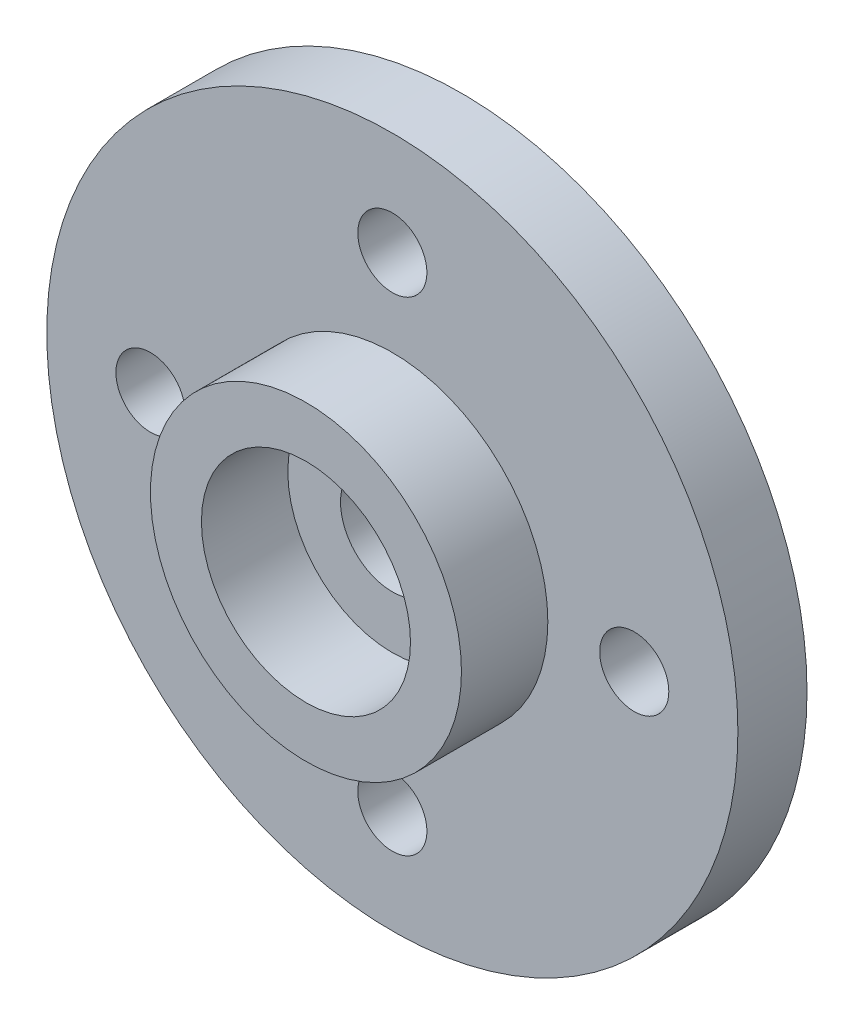
ISO-10303-21;
HEADER;
FILE_DESCRIPTION(('STEP AP214'),'2;1');
FILE_NAME('part.step','',(''),(''),'','','');
FILE_SCHEMA(('AUTOMOTIVE_DESIGN { 1 0 10303 214 1 1 1 1 }'));
ENDSEC;
DATA;
#1=APPLICATION_CONTEXT('core data for automotive mechanical design processes');
#2=APPLICATION_PROTOCOL_DEFINITION('international standard','automotive_design',2000,#1);
#3=PRODUCT_CONTEXT('',#1,'mechanical');
#4=PRODUCT('Part','Part','',(#3));
#5=PRODUCT_RELATED_PRODUCT_CATEGORY('part','',(#4));
#6=PRODUCT_DEFINITION_FORMATION('','',#4);
#7=PRODUCT_DEFINITION_CONTEXT('part definition',#1,'design');
#8=PRODUCT_DEFINITION('design','',#6,#7);
#9=PRODUCT_DEFINITION_SHAPE('','',#8);
#10=(LENGTH_UNIT() NAMED_UNIT(*) SI_UNIT(.MILLI.,.METRE.));
#11=(NAMED_UNIT(*) PLANE_ANGLE_UNIT() SI_UNIT($,.RADIAN.));
#12=(NAMED_UNIT(*) SI_UNIT($,.STERADIAN.) SOLID_ANGLE_UNIT());
#13=UNCERTAINTY_MEASURE_WITH_UNIT(LENGTH_MEASURE(1.E-05),#10,'distance_accuracy_value','');
#14=(GEOMETRIC_REPRESENTATION_CONTEXT(3) GLOBAL_UNCERTAINTY_ASSIGNED_CONTEXT((#13)) GLOBAL_UNIT_ASSIGNED_CONTEXT((#10,
#11,#12)) REPRESENTATION_CONTEXT('',''));
#15=CARTESIAN_POINT('',(0.,0.,0.));
#16=DIRECTION('',(0.,0.,1.));
#17=DIRECTION('',(1.,0.,0.));
#18=AXIS2_PLACEMENT_3D('',#15,#16,#17);
#19=CARTESIAN_POINT('',(0.,0.,2.));
#20=DIRECTION('',(0.,0.,1.));
#21=DIRECTION('',(1.,0.,0.));
#22=AXIS2_PLACEMENT_3D('',#19,#20,#21);
#23=PLANE('',#22);
#24=CARTESIAN_POINT('',(0.,0.,2.));
#25=DIRECTION('',(0.,0.,1.));
#26=DIRECTION('',(1.,0.,0.));
#27=AXIS2_PLACEMENT_3D('',#24,#25,#26);
#28=CIRCLE('',#27,1.50000000000006);
#29=CARTESIAN_POINT('',(1.50000000000006,0.,2.));
#30=VERTEX_POINT('',#29);
#31=EDGE_CURVE('E57',#30,#30,#28,.T.);
#32=ORIENTED_EDGE('',*,*,#31,.F.);
#33=EDGE_LOOP('',(#32));
#34=FACE_BOUND('',#33,.T.);
#35=CARTESIAN_POINT('',(0.,0.,2.));
#36=DIRECTION('',(0.,0.,1.));
#37=DIRECTION('',(1.,0.,0.));
#38=AXIS2_PLACEMENT_3D('',#35,#36,#37);
#39=CIRCLE('',#38,3.025);
#40=CARTESIAN_POINT('',(3.025,0.,2.));
#41=VERTEX_POINT('',#40);
#42=EDGE_CURVE('E10',#41,#41,#39,.F.);
#43=ORIENTED_EDGE('',*,*,#42,.F.);
#44=EDGE_LOOP('',(#43));
#45=FACE_BOUND('',#44,.T.);
#46=ADVANCED_FACE('F30',(#34,#45),#23,.T.);
#47=CARTESIAN_POINT('',(0.,0.,2.));
#48=DIRECTION('',(0.,0.,1.));
#49=DIRECTION('',(1.,0.,0.));
#50=AXIS2_PLACEMENT_3D('',#47,#48,#49);
#51=CIRCLE('',#50,4.5);
#52=CARTESIAN_POINT('',(4.5,0.,2.));
#53=VERTEX_POINT('',#52);
#54=EDGE_CURVE('E78',#53,#53,#51,.T.);
#55=ORIENTED_EDGE('',*,*,#54,.F.);
#56=EDGE_LOOP('',(#55));
#57=FACE_BOUND('',#56,.T.);
#58=CARTESIAN_POINT('',(0.,-7.,2.));
#59=DIRECTION('',(0.,0.,1.));
#60=DIRECTION('',(-1.,0.,0.));
#61=AXIS2_PLACEMENT_3D('',#58,#59,#60);
#62=CIRCLE('',#61,1.);
#63=CARTESIAN_POINT('',(-1.,-7.,2.));
#64=VERTEX_POINT('',#63);
#65=EDGE_CURVE('E63',#64,#64,#62,.T.);
#66=ORIENTED_EDGE('',*,*,#65,.F.);
#67=EDGE_LOOP('',(#66));
#68=FACE_BOUND('',#67,.T.);
#69=CARTESIAN_POINT('',(0.,7.,2.));
#70=DIRECTION('',(0.,0.,1.));
#71=DIRECTION('',(1.,0.,0.));
#72=AXIS2_PLACEMENT_3D('',#69,#70,#71);
#73=CIRCLE('',#72,1.);
#74=CARTESIAN_POINT('',(1.,7.,2.));
#75=VERTEX_POINT('',#74);
#76=EDGE_CURVE('E51',#75,#75,#73,.T.);
#77=ORIENTED_EDGE('',*,*,#76,.F.);
#78=EDGE_LOOP('',(#77));
#79=FACE_BOUND('',#78,.T.);
#80=CARTESIAN_POINT('',(0.,0.,2.));
#81=DIRECTION('',(0.,0.,1.));
#82=DIRECTION('',(1.,0.,0.));
#83=AXIS2_PLACEMENT_3D('',#80,#81,#82);
#84=CIRCLE('',#83,10.);
#85=CARTESIAN_POINT('',(10.,0.,2.));
#86=VERTEX_POINT('',#85);
#87=EDGE_CURVE('E37',#86,#86,#84,.T.);
#88=ORIENTED_EDGE('',*,*,#87,.T.);
#89=EDGE_LOOP('',(#88));
#90=FACE_BOUND('',#89,.T.);
#91=CARTESIAN_POINT('',(7.,0.,2.));
#92=DIRECTION('',(0.,0.,1.));
#93=DIRECTION('',(1.,0.,0.));
#94=AXIS2_PLACEMENT_3D('',#91,#92,#93);
#95=CIRCLE('',#94,1.);
#96=CARTESIAN_POINT('',(8.,0.,2.));
#97=VERTEX_POINT('',#96);
#98=EDGE_CURVE('E46',#97,#97,#95,.T.);
#99=ORIENTED_EDGE('',*,*,#98,.F.);
#100=EDGE_LOOP('',(#99));
#101=FACE_BOUND('',#100,.T.);
#102=CARTESIAN_POINT('',(-7.,0.,2.));
#103=DIRECTION('',(0.,0.,1.));
#104=DIRECTION('',(-1.,0.,0.));
#105=AXIS2_PLACEMENT_3D('',#102,#103,#104);
#106=CIRCLE('',#105,1.);
#107=CARTESIAN_POINT('',(-8.,0.,2.));
#108=VERTEX_POINT('',#107);
#109=EDGE_CURVE('E69',#108,#108,#106,.T.);
#110=ORIENTED_EDGE('',*,*,#109,.F.);
#111=EDGE_LOOP('',(#110));
#112=FACE_BOUND('',#111,.T.);
#113=ADVANCED_FACE('F106',(#57,#68,#79,#90,#101,#112),#23,.T.);
#114=CARTESIAN_POINT('',(0.,0.,0.));
#115=DIRECTION('',(0.,0.,1.));
#116=DIRECTION('',(1.,0.,0.));
#117=AXIS2_PLACEMENT_3D('',#114,#115,#116);
#118=PLANE('',#117);
#119=CARTESIAN_POINT('',(0.,0.,0.));
#120=DIRECTION('',(0.,0.,1.));
#121=DIRECTION('',(1.,0.,0.));
#122=AXIS2_PLACEMENT_3D('',#119,#120,#121);
#123=CIRCLE('',#122,10.);
#124=CARTESIAN_POINT('',(10.,0.,0.));
#125=VERTEX_POINT('',#124);
#126=EDGE_CURVE('E41',#125,#125,#123,.T.);
#127=ORIENTED_EDGE('',*,*,#126,.F.);
#128=EDGE_LOOP('',(#127));
#129=FACE_BOUND('',#128,.T.);
#130=CARTESIAN_POINT('',(7.,0.,0.));
#131=DIRECTION('',(0.,0.,1.));
#132=DIRECTION('',(1.,0.,0.));
#133=AXIS2_PLACEMENT_3D('',#130,#131,#132);
#134=CIRCLE('',#133,1.);
#135=CARTESIAN_POINT('',(8.,0.,0.));
#136=VERTEX_POINT('',#135);
#137=EDGE_CURVE('E48',#136,#136,#134,.T.);
#138=ORIENTED_EDGE('',*,*,#137,.T.);
#139=EDGE_LOOP('',(#138));
#140=FACE_BOUND('',#139,.T.);
#141=CARTESIAN_POINT('',(0.,7.,0.));
#142=DIRECTION('',(0.,0.,1.));
#143=DIRECTION('',(1.,0.,0.));
#144=AXIS2_PLACEMENT_3D('',#141,#142,#143);
#145=CIRCLE('',#144,1.);
#146=CARTESIAN_POINT('',(1.,7.,0.));
#147=VERTEX_POINT('',#146);
#148=EDGE_CURVE('E54',#147,#147,#145,.T.);
#149=ORIENTED_EDGE('',*,*,#148,.T.);
#150=EDGE_LOOP('',(#149));
#151=FACE_BOUND('',#150,.T.);
#152=CARTESIAN_POINT('',(0.,0.,0.));
#153=DIRECTION('',(0.,0.,1.));
#154=DIRECTION('',(1.,0.,0.));
#155=AXIS2_PLACEMENT_3D('',#152,#153,#154);
#156=CIRCLE('',#155,1.50000000000006);
#157=CARTESIAN_POINT('',(1.50000000000006,0.,0.));
#158=VERTEX_POINT('',#157);
#159=EDGE_CURVE('E60',#158,#158,#156,.T.);
#160=ORIENTED_EDGE('',*,*,#159,.T.);
#161=EDGE_LOOP('',(#160));
#162=FACE_BOUND('',#161,.T.);
#163=CARTESIAN_POINT('',(0.,-7.,0.));
#164=DIRECTION('',(0.,0.,1.));
#165=DIRECTION('',(-1.,0.,0.));
#166=AXIS2_PLACEMENT_3D('',#163,#164,#165);
#167=CIRCLE('',#166,1.);
#168=CARTESIAN_POINT('',(-1.,-7.,0.));
#169=VERTEX_POINT('',#168);
#170=EDGE_CURVE('E66',#169,#169,#167,.T.);
#171=ORIENTED_EDGE('',*,*,#170,.T.);
#172=EDGE_LOOP('',(#171));
#173=FACE_BOUND('',#172,.T.);
#174=CARTESIAN_POINT('',(-7.,0.,0.));
#175=DIRECTION('',(0.,0.,1.));
#176=DIRECTION('',(-1.,0.,0.));
#177=AXIS2_PLACEMENT_3D('',#174,#175,#176);
#178=CIRCLE('',#177,1.);
#179=CARTESIAN_POINT('',(-8.,0.,0.));
#180=VERTEX_POINT('',#179);
#181=EDGE_CURVE('E72',#180,#180,#178,.T.);
#182=ORIENTED_EDGE('',*,*,#181,.T.);
#183=EDGE_LOOP('',(#182));
#184=FACE_BOUND('',#183,.T.);
#185=ADVANCED_FACE('F112',(#129,#140,#151,#162,#173,#184),#118,.F.);
#186=CARTESIAN_POINT('',(0.,0.,2.));
#187=DIRECTION('',(0.,0.,-1.));
#188=DIRECTION('',(-1.,0.,0.));
#189=AXIS2_PLACEMENT_3D('',#186,#187,#188);
#190=CYLINDRICAL_SURFACE('',#189,10.);
#191=ORIENTED_EDGE('',*,*,#87,.F.);
#192=EDGE_LOOP('',(#191));
#193=FACE_BOUND('',#192,.T.);
#194=ORIENTED_EDGE('',*,*,#126,.T.);
#195=EDGE_LOOP('',(#194));
#196=FACE_BOUND('',#195,.T.);
#197=ADVANCED_FACE('F32',(#193,#196),#190,.T.);
#198=CARTESIAN_POINT('',(7.,0.,2.));
#199=DIRECTION('',(0.,0.,-1.));
#200=DIRECTION('',(-1.,0.,0.));
#201=AXIS2_PLACEMENT_3D('',#198,#199,#200);
#202=CYLINDRICAL_SURFACE('',#201,1.);
#203=ORIENTED_EDGE('',*,*,#98,.T.);
#204=EDGE_LOOP('',(#203));
#205=FACE_BOUND('',#204,.T.);
#206=ORIENTED_EDGE('',*,*,#137,.F.);
#207=EDGE_LOOP('',(#206));
#208=FACE_BOUND('',#207,.T.);
#209=ADVANCED_FACE('F117',(#205,#208),#202,.F.);
#210=CARTESIAN_POINT('',(0.,7.,2.));
#211=DIRECTION('',(0.,0.,-1.));
#212=DIRECTION('',(-1.,0.,0.));
#213=AXIS2_PLACEMENT_3D('',#210,#211,#212);
#214=CYLINDRICAL_SURFACE('',#213,1.);
#215=ORIENTED_EDGE('',*,*,#76,.T.);
#216=EDGE_LOOP('',(#215));
#217=FACE_BOUND('',#216,.T.);
#218=ORIENTED_EDGE('',*,*,#148,.F.);
#219=EDGE_LOOP('',(#218));
#220=FACE_BOUND('',#219,.T.);
#221=ADVANCED_FACE('F145',(#217,#220),#214,.F.);
#222=CARTESIAN_POINT('',(0.,0.,2.));
#223=DIRECTION('',(0.,0.,-1.));
#224=DIRECTION('',(-1.,0.,0.));
#225=AXIS2_PLACEMENT_3D('',#222,#223,#224);
#226=CYLINDRICAL_SURFACE('',#225,1.50000000000006);
#227=ORIENTED_EDGE('',*,*,#31,.T.);
#228=EDGE_LOOP('',(#227));
#229=FACE_BOUND('',#228,.T.);
#230=ORIENTED_EDGE('',*,*,#159,.F.);
#231=EDGE_LOOP('',(#230));
#232=FACE_BOUND('',#231,.T.);
#233=ADVANCED_FACE('F139',(#229,#232),#226,.F.);
#234=CARTESIAN_POINT('',(0.,-7.,2.));
#235=DIRECTION('',(0.,0.,-1.));
#236=DIRECTION('',(-1.,0.,0.));
#237=AXIS2_PLACEMENT_3D('',#234,#235,#236);
#238=CYLINDRICAL_SURFACE('',#237,1.);
#239=ORIENTED_EDGE('',*,*,#65,.T.);
#240=EDGE_LOOP('',(#239));
#241=FACE_BOUND('',#240,.T.);
#242=ORIENTED_EDGE('',*,*,#170,.F.);
#243=EDGE_LOOP('',(#242));
#244=FACE_BOUND('',#243,.T.);
#245=ADVANCED_FACE('F101',(#241,#244),#238,.F.);
#246=CARTESIAN_POINT('',(-7.,0.,2.));
#247=DIRECTION('',(0.,0.,-1.));
#248=DIRECTION('',(-1.,0.,0.));
#249=AXIS2_PLACEMENT_3D('',#246,#247,#248);
#250=CYLINDRICAL_SURFACE('',#249,1.);
#251=ORIENTED_EDGE('',*,*,#109,.T.);
#252=EDGE_LOOP('',(#251));
#253=FACE_BOUND('',#252,.T.);
#254=ORIENTED_EDGE('',*,*,#181,.F.);
#255=EDGE_LOOP('',(#254));
#256=FACE_BOUND('',#255,.T.);
#257=ADVANCED_FACE('F92',(#253,#256),#250,.F.);
#258=CARTESIAN_POINT('',(0.,0.,4.5));
#259=DIRECTION('',(0.,0.,1.));
#260=DIRECTION('',(1.,0.,0.));
#261=AXIS2_PLACEMENT_3D('',#258,#259,#260);
#262=PLANE('',#261);
#263=CARTESIAN_POINT('',(0.,0.,4.5));
#264=DIRECTION('',(0.,0.,1.));
#265=DIRECTION('',(1.,0.,0.));
#266=AXIS2_PLACEMENT_3D('',#263,#264,#265);
#267=CIRCLE('',#266,4.5);
#268=CARTESIAN_POINT('',(4.5,0.,4.5));
#269=VERTEX_POINT('',#268);
#270=EDGE_CURVE('E75',#269,#269,#267,.T.);
#271=ORIENTED_EDGE('',*,*,#270,.T.);
#272=EDGE_LOOP('',(#271));
#273=FACE_BOUND('',#272,.T.);
#274=CARTESIAN_POINT('',(0.,0.,4.5));
#275=DIRECTION('',(0.,0.,1.));
#276=DIRECTION('',(1.,0.,0.));
#277=AXIS2_PLACEMENT_3D('',#274,#275,#276);
#278=CIRCLE('',#277,3.025);
#279=CARTESIAN_POINT('',(3.025,0.,4.5));
#280=VERTEX_POINT('',#279);
#281=EDGE_CURVE('E81',#280,#280,#278,.T.);
#282=ORIENTED_EDGE('',*,*,#281,.F.);
#283=EDGE_LOOP('',(#282));
#284=FACE_BOUND('',#283,.T.);
#285=ADVANCED_FACE('F89',(#273,#284),#262,.T.);
#286=CARTESIAN_POINT('',(0.,0.,4.5));
#287=DIRECTION('',(0.,0.,-1.));
#288=DIRECTION('',(-1.,0.,0.));
#289=AXIS2_PLACEMENT_3D('',#286,#287,#288);
#290=CYLINDRICAL_SURFACE('',#289,4.5);
#291=ORIENTED_EDGE('',*,*,#270,.F.);
#292=EDGE_LOOP('',(#291));
#293=FACE_BOUND('',#292,.T.);
#294=ORIENTED_EDGE('',*,*,#54,.T.);
#295=EDGE_LOOP('',(#294));
#296=FACE_BOUND('',#295,.T.);
#297=ADVANCED_FACE('F91',(#293,#296),#290,.T.);
#298=CARTESIAN_POINT('',(0.,0.,4.5));
#299=DIRECTION('',(0.,0.,-1.));
#300=DIRECTION('',(-1.,0.,0.));
#301=AXIS2_PLACEMENT_3D('',#298,#299,#300);
#302=CYLINDRICAL_SURFACE('',#301,3.025);
#303=ORIENTED_EDGE('',*,*,#281,.T.);
#304=EDGE_LOOP('',(#303));
#305=FACE_BOUND('',#304,.T.);
#306=ORIENTED_EDGE('',*,*,#42,.T.);
#307=EDGE_LOOP('',(#306));
#308=FACE_BOUND('',#307,.T.);
#309=ADVANCED_FACE('F87',(#305,#308),#302,.F.);
#310=CLOSED_SHELL('',(#46,#113,#185,#197,#209,#221,#233,#245,#257,#285,#297,#309));
#311=MANIFOLD_SOLID_BREP('B2',#310);
#312=ADVANCED_BREP_SHAPE_REPRESENTATION('',(#18,#311),#14);
#313=SHAPE_DEFINITION_REPRESENTATION(#9,#312);
ENDSEC;
END-ISO-10303-21;
